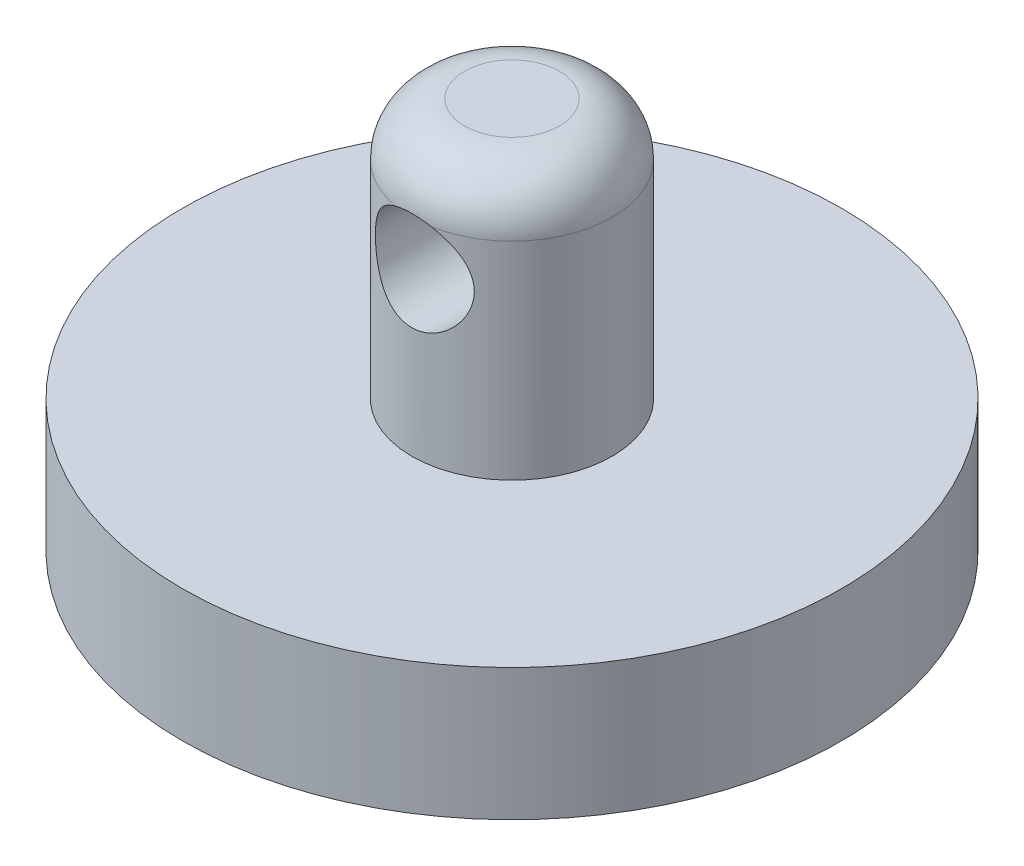
ISO-10303-21;
HEADER;
FILE_DESCRIPTION(('STEP AP214'),'2;1');
FILE_NAME('part.step','',(''),(''),'','','');
FILE_SCHEMA(('AUTOMOTIVE_DESIGN { 1 0 10303 214 1 1 1 1 }'));
ENDSEC;
DATA;
#1=APPLICATION_CONTEXT('core data for automotive mechanical design processes');
#2=APPLICATION_PROTOCOL_DEFINITION('international standard','automotive_design',2000,#1);
#3=PRODUCT_CONTEXT('',#1,'mechanical');
#4=PRODUCT('Part','Part','',(#3));
#5=PRODUCT_RELATED_PRODUCT_CATEGORY('part','',(#4));
#6=PRODUCT_DEFINITION_FORMATION('','',#4);
#7=PRODUCT_DEFINITION_CONTEXT('part definition',#1,'design');
#8=PRODUCT_DEFINITION('design','',#6,#7);
#9=PRODUCT_DEFINITION_SHAPE('','',#8);
#10=(LENGTH_UNIT() NAMED_UNIT(*) SI_UNIT(.MILLI.,.METRE.));
#11=(NAMED_UNIT(*) PLANE_ANGLE_UNIT() SI_UNIT($,.RADIAN.));
#12=(NAMED_UNIT(*) SI_UNIT($,.STERADIAN.) SOLID_ANGLE_UNIT());
#13=UNCERTAINTY_MEASURE_WITH_UNIT(LENGTH_MEASURE(1.E-05),#10,'distance_accuracy_value','');
#14=(GEOMETRIC_REPRESENTATION_CONTEXT(3) GLOBAL_UNCERTAINTY_ASSIGNED_CONTEXT((#13)) GLOBAL_UNIT_ASSIGNED_CONTEXT((#10,
#11,#12)) REPRESENTATION_CONTEXT('',''));
#15=CARTESIAN_POINT('',(0.,0.,0.));
#16=DIRECTION('',(0.,0.,1.));
#17=DIRECTION('',(1.,0.,0.));
#18=AXIS2_PLACEMENT_3D('',#15,#16,#17);
#19=CARTESIAN_POINT('',(0.,0.,0.));
#20=DIRECTION('',(0.,-1.,0.));
#21=DIRECTION('',(0.,0.,-1.));
#22=AXIS2_PLACEMENT_3D('',#19,#20,#21);
#23=PLANE('',#22);
#24=CARTESIAN_POINT('',(0.,0.,0.));
#25=DIRECTION('',(0.,1.,0.));
#26=DIRECTION('',(0.,0.,1.));
#27=AXIS2_PLACEMENT_3D('',#24,#25,#26);
#28=CIRCLE('',#27,2.28599999999998);
#29=CARTESIAN_POINT('',(0.,0.,2.28599999999998));
#30=VERTEX_POINT('',#29);
#31=EDGE_CURVE('E67',#30,#30,#28,.T.);
#32=ORIENTED_EDGE('',*,*,#31,.T.);
#33=EDGE_LOOP('',(#32));
#34=FACE_BOUND('',#33,.T.);
#35=ADVANCED_FACE('F32',(#34),#23,.F.);
#36=CARTESIAN_POINT('',(0.,-2.54,0.));
#37=DIRECTION('',(0.,1.,0.));
#38=DIRECTION('',(0.,0.,1.));
#39=AXIS2_PLACEMENT_3D('',#36,#37,#38);
#40=DEGENERATE_TOROIDAL_SURFACE('',#39,2.286,2.54,.T.);
#41=ORIENTED_EDGE('',*,*,#31,.F.);
#42=EDGE_LOOP('',(#41));
#43=FACE_BOUND('',#42,.T.);
#44=CARTESIAN_POINT('',(0.,-2.54000000000002,0.));
#45=DIRECTION('',(0.,1.,0.));
#46=DIRECTION('',(0.,0.,1.));
#47=AXIS2_PLACEMENT_3D('',#44,#45,#46);
#48=CIRCLE('',#47,4.826);
#49=CARTESIAN_POINT('',(-0.854894913132647,-2.54000000000002,-4.74967690348511));
#50=VERTEX_POINT('',#49);
#51=CARTESIAN_POINT('',(-0.854894913132647,-2.54000000000002,4.74967690348511));
#52=VERTEX_POINT('',#51);
#53=EDGE_CURVE('E72',#50,#52,#48,.T.);
#54=ORIENTED_EDGE('',*,*,#53,.T.);
#55=CARTESIAN_POINT('',(-0.855414678680976,-2.54020000000065,4.74958331345994));
#56=CARTESIAN_POINT('',(-0.798845324391578,-2.51841518183945,4.75977168585689));
#57=CARTESIAN_POINT('',(-0.741261008064853,-2.49873980990101,4.76881768916786));
#58=CARTESIAN_POINT('',(-0.624476488291599,-2.4637863719272,4.78469701894869));
#59=CARTESIAN_POINT('',(-0.565276314999579,-2.44850822389384,4.79153038667936));
#60=CARTESIAN_POINT('',(-0.445643026982296,-2.42252053251116,4.80305967126597));
#61=CARTESIAN_POINT('',(-0.385209329257438,-2.4118132044287,4.8077545517689));
#62=CARTESIAN_POINT('',(-0.263589746941185,-2.39508696531306,4.81505203007644));
#63=CARTESIAN_POINT('',(-0.202403897227714,-2.38906783771087,4.81765472452871));
#64=CARTESIAN_POINT('',(-0.0182782923249988,-2.37815389149867,4.82237883996243));
#65=CARTESIAN_POINT('',(0.105249390678226,-2.38039819367889,4.82141815759051));
#66=CARTESIAN_POINT('',(0.349916744366821,-2.40390247992268,4.81122056406166));
#67=CARTESIAN_POINT('',(0.471060391608101,-2.42512745938037,4.80199888796657));
#68=CARTESIAN_POINT('',(0.634620923965451,-2.46689346130696,4.78327439134968));
#69=CARTESIAN_POINT('',(0.679532622027652,-2.4797902369759,4.77744928779252));
#70=CARTESIAN_POINT('',(0.768291295196524,-2.50811684255922,4.76449994639135));
#71=CARTESIAN_POINT('',(0.812139616742324,-2.52354325406144,4.75737746033944));
#72=CARTESIAN_POINT('',(0.855414678680977,-2.54020000000065,4.74958331345994));
#73=B_SPLINE_CURVE_WITH_KNOTS('',3,(#55,#56,#57,#58,#59,#60,#61,#62,#63,#64,#65,#66,#67,#68,#69,
#70,#71,#72),.UNSPECIFIED.,.F.,.F.,(4,2,2,2,2,2,2,2,4),(0.,0.184348303482079,0.36869316907515,
0.553127277017148,0.737552864614694,1.1063435604013,1.4744555232586,1.61564262981383,
1.7566404927481),.UNSPECIFIED.);
#74=CARTESIAN_POINT('',(0.854894913132648,-2.54000000000002,4.74967690348511));
#75=VERTEX_POINT('',#74);
#76=EDGE_CURVE('E51',#52,#75,#73,.T.);
#77=ORIENTED_EDGE('',*,*,#76,.T.);
#78=CARTESIAN_POINT('',(0.854894913132648,-2.54000000000002,-4.74967690348511));
#79=VERTEX_POINT('',#78);
#80=EDGE_CURVE('E71',#75,#79,#48,.T.);
#81=ORIENTED_EDGE('',*,*,#80,.T.);
#82=CARTESIAN_POINT('',(0.855414678680977,-2.54020000000065,-4.74958331345994));
#83=CARTESIAN_POINT('',(0.798845324391578,-2.51841518183945,-4.75977168585689));
#84=CARTESIAN_POINT('',(0.741261008064853,-2.49873980990101,-4.76881768916786));
#85=CARTESIAN_POINT('',(0.6244764882916,-2.4637863719272,-4.78469701894869));
#86=CARTESIAN_POINT('',(0.565276314999579,-2.44850822389384,-4.79153038667936));
#87=CARTESIAN_POINT('',(0.445643026982297,-2.42252053251116,-4.80305967126597));
#88=CARTESIAN_POINT('',(0.385209329257439,-2.4118132044287,-4.8077545517689));
#89=CARTESIAN_POINT('',(0.263589746941186,-2.39508696531306,-4.81505203007644));
#90=CARTESIAN_POINT('',(0.202403897227715,-2.38906783771087,-4.81765472452871));
#91=CARTESIAN_POINT('',(0.0182782923249999,-2.37815389149867,-4.82237883996243));
#92=CARTESIAN_POINT('',(-0.105249390678225,-2.38039819367889,-4.82141815759051));
#93=CARTESIAN_POINT('',(-0.34991674436682,-2.40390247992268,-4.81122056406166));
#94=CARTESIAN_POINT('',(-0.4710603916081,-2.42512745938037,-4.80199888796657));
#95=CARTESIAN_POINT('',(-0.63462092396545,-2.46689346130695,-4.78327439134968));
#96=CARTESIAN_POINT('',(-0.679532622027651,-2.4797902369759,-4.77744928779252));
#97=CARTESIAN_POINT('',(-0.768291295196523,-2.50811684255922,-4.76449994639135));
#98=CARTESIAN_POINT('',(-0.812139616742324,-2.52354325406144,-4.75737746033944));
#99=CARTESIAN_POINT('',(-0.855414678680976,-2.54020000000065,-4.74958331345994));
#100=B_SPLINE_CURVE_WITH_KNOTS('',3,(#82,#83,#84,#85,#86,#87,#88,#89,#90,#91,#92,#93,#94,#95,
#96,#97,#98,#99),.UNSPECIFIED.,.F.,.F.,(4,2,2,2,2,2,2,2,4),(0.,0.184348303482079,
0.36869316907515,0.553127277017148,0.737552864614694,1.1063435604013,1.4744555232586,
1.61564262981383,1.7566404927481),.UNSPECIFIED.);
#101=EDGE_CURVE('E58',#79,#50,#100,.T.);
#102=ORIENTED_EDGE('',*,*,#101,.T.);
#103=EDGE_LOOP('',(#54,#77,#81,#102));
#104=FACE_BOUND('',#103,.T.);
#105=ADVANCED_FACE('F70',(#43,#104),#40,.T.);
#106=CARTESIAN_POINT('',(0.,0.,0.));
#107=DIRECTION('',(0.,1.,0.));
#108=DIRECTION('',(0.,0.,1.));
#109=AXIS2_PLACEMENT_3D('',#106,#107,#108);
#110=CYLINDRICAL_SURFACE('',#109,4.826);
#111=ORIENTED_EDGE('',*,*,#53,.F.);
#112=CARTESIAN_POINT('',(-0.854894913132647,-2.54000000000002,-4.74967690348511));
#113=CARTESIAN_POINT('',(-0.918697906129766,-2.56454262486804,-4.73819803028183));
#114=CARTESIAN_POINT('',(-0.981224683950843,-2.59174822008641,-4.72561072201682));
#115=CARTESIAN_POINT('',(-1.10336933098255,-2.65121090650748,-4.69859066607849));
#116=CARTESIAN_POINT('',(-1.16298882273051,-2.68346513678518,-4.68415896441787));
#117=CARTESIAN_POINT('',(-1.33672397672351,-2.78723611352102,-4.63871963124173));
#118=CARTESIAN_POINT('',(-1.4460874709041,-2.86590557496671,-4.60549743426115));
#119=CARTESIAN_POINT('',(-1.64938715078415,-3.03977915096064,-4.53666537173904));
#120=CARTESIAN_POINT('',(-1.74334965913681,-3.13495446897237,-4.50105972976353));
#121=CARTESIAN_POINT('',(-1.91436141127674,-3.34003635587842,-4.43103149961965));
#122=CARTESIAN_POINT('',(-1.99139432669877,-3.44995698334565,-4.39661008036572));
#123=CARTESIAN_POINT('',(-2.12866541624622,-3.6862078882421,-4.33186166261805));
#124=CARTESIAN_POINT('',(-2.18826477843525,-3.81296027190604,-4.30170746764923));
#125=CARTESIAN_POINT('',(-2.28464442023298,-4.07665301233523,-4.25131464004079));
#126=CARTESIAN_POINT('',(-2.32145628156328,-4.2135789729935,-4.23106229242726));
#127=CARTESIAN_POINT('',(-2.36789615950473,-4.47981976565405,-4.20523330627634));
#128=CARTESIAN_POINT('',(-2.37977352244394,-4.60862271078016,-4.19844573112953));
#129=CARTESIAN_POINT('',(-2.38246531467668,-4.86650222813918,-4.19692116085298));
#130=CARTESIAN_POINT('',(-2.37328749167973,-4.99557868226654,-4.20217973308262));
#131=CARTESIAN_POINT('',(-2.3362176745992,-5.23800958142674,-4.22288263817493));
#132=CARTESIAN_POINT('',(-2.31009881618014,-5.35172806871109,-4.23735972133812));
#133=CARTESIAN_POINT('',(-2.24204448185467,-5.57305678937097,-4.27375626840105));
#134=CARTESIAN_POINT('',(-2.20010421052479,-5.68066515939945,-4.29567798854706));
#135=CARTESIAN_POINT('',(-2.0984408123693,-5.89469500777598,-4.34629091077114));
#136=CARTESIAN_POINT('',(-2.03771404895297,-6.00055332616934,-4.37533740492223));
#137=CARTESIAN_POINT('',(-1.90132562646585,-6.20126805421784,-4.43630662075642));
#138=CARTESIAN_POINT('',(-1.82565543976383,-6.29611813259951,-4.46823097904459));
#139=CARTESIAN_POINT('',(-1.65110136482988,-6.48368884429494,-4.53584423785158));
#140=CARTESIAN_POINT('',(-1.55053506213778,-6.57485187155657,-4.57153504194166));
#141=CARTESIAN_POINT('',(-1.33455073319679,-6.73930188653307,-4.63918610009534));
#142=CARTESIAN_POINT('',(-1.2191306872774,-6.81258643937224,-4.67114584571606));
#143=CARTESIAN_POINT('',(-0.975539309221541,-6.9390942903712,-4.72803112151971));
#144=CARTESIAN_POINT('',(-0.847322962177582,-6.99224337063715,-4.75293054468792));
#145=CARTESIAN_POINT('',(-0.58219444367384,-7.07565067482056,-4.79262256106949));
#146=CARTESIAN_POINT('',(-0.445290055720089,-7.10592908301698,-4.8074240649791));
#147=CARTESIAN_POINT('',(-0.180851118794648,-7.14024978449016,-4.82425404419044));
#148=CARTESIAN_POINT('',(-0.0536727664306179,-7.14652441858962,-4.82736877925288));
#149=CARTESIAN_POINT('',(0.199888687164915,-7.13873052832653,-4.82352366194231));
#150=CARTESIAN_POINT('',(0.326271961388649,-7.12466659461493,-4.81656608300719));
#151=CARTESIAN_POINT('',(0.568138809473482,-7.07809711466594,-4.79390575004921));
#152=CARTESIAN_POINT('',(0.683851789293184,-7.04654441064228,-4.77865555666441));
#153=CARTESIAN_POINT('',(0.908230490841923,-6.96696093818696,-4.74113320244692));
#154=CARTESIAN_POINT('',(1.01689496712162,-6.91892726699795,-4.71885980468836));
#155=CARTESIAN_POINT('',(1.23084069416942,-6.80477910660687,-4.66777032829462));
#156=CARTESIAN_POINT('',(1.33558743672603,-6.73779924389603,-4.6386565998771));
#157=CARTESIAN_POINT('',(1.53288397685072,-6.58894746248519,-4.57725224141138));
#158=CARTESIAN_POINT('',(1.62542652766842,-6.50706676384706,-4.54495974353178));
#159=CARTESIAN_POINT('',(1.80496176245297,-6.32156481350912,-4.47688136746997));
#160=CARTESIAN_POINT('',(1.89056906608956,-6.21661115328117,-4.44105770005153));
#161=CARTESIAN_POINT('',(2.04324336283442,-5.99288619698136,-4.37292118485586));
#162=CARTESIAN_POINT('',(2.11030548597586,-5.8741112830585,-4.34060926061243));
#163=CARTESIAN_POINT('',(2.22408542382287,-5.62432794914865,-4.2834361924549));
#164=CARTESIAN_POINT('',(2.27065281791041,-5.49323737561122,-4.25863054198336));
#165=CARTESIAN_POINT('',(2.34035362629354,-5.22341105933853,-4.220739919429));
#166=CARTESIAN_POINT('',(2.36352047589663,-5.08468652412647,-4.20763822753071));
#167=CARTESIAN_POINT('',(2.38375171276014,-4.82120658731006,-4.19620122770495));
#168=CARTESIAN_POINT('',(2.38356249529589,-4.6967243598064,-4.19631220564923));
#169=CARTESIAN_POINT('',(2.36387505352875,-4.44980111002393,-4.20743343067267));
#170=CARTESIAN_POINT('',(2.34437678838527,-4.32736009206304,-4.21844370080494));
#171=CARTESIAN_POINT('',(2.2885588556227,-4.0943037330664,-4.24896540656508));
#172=CARTESIAN_POINT('',(2.25315173722372,-3.98340389597403,-4.26801262771717));
#173=CARTESIAN_POINT('',(2.16716714143362,-3.76897452328591,-4.31230700515303));
#174=CARTESIAN_POINT('',(2.1165830071932,-3.6654482465418,-4.33755688112441));
#175=CARTESIAN_POINT('',(1.99580974530487,-3.4575179104816,-4.39453161681926));
#176=CARTESIAN_POINT('',(1.92416030615849,-3.35407322458577,-4.4266523189385));
#177=CARTESIAN_POINT('',(1.76572495733624,-3.15992146249739,-4.49219574251483));
#178=CARTESIAN_POINT('',(1.67893707577731,-3.06921604846186,-4.52561863314965));
#179=CARTESIAN_POINT('',(1.53243862543094,-2.9384830467379,-4.57657833332629));
#180=CARTESIAN_POINT('',(1.4772692772319,-2.89351470587481,-4.59472904166961));
#181=CARTESIAN_POINT('',(1.36288914902576,-2.80854056994953,-4.62994461727904));
#182=CARTESIAN_POINT('',(1.30367853161966,-2.76853457540892,-4.64700952817904));
#183=CARTESIAN_POINT('',(1.18143391857,-2.69375421440278,-4.67958256634308));
#184=CARTESIAN_POINT('',(1.11839144434224,-2.65899208932194,-4.69508702363469));
#185=CARTESIAN_POINT('',(0.98900482335215,-2.59514298284769,-4.72404165165338));
#186=CARTESIAN_POINT('',(0.922658906334727,-2.56605908630101,-4.73749070487124));
#187=CARTESIAN_POINT('',(0.854894913132648,-2.54000000000002,-4.74967690348511));
#188=B_SPLINE_CURVE_WITH_KNOTS('',3,(#112,#113,#114,#115,#116,#117,#118,#119,#120,#121,#122,
#123,#124,#125,#126,#127,#128,#129,#130,#131,#132,#133,#134,#135,#136,#137,#138,#139,#140,#141,
#142,#143,#144,#145,#146,#147,#148,#149,#150,#151,#152,#153,#154,#155,#156,#157,#158,#159,#160,
#161,#162,#163,#164,#165,#166,#167,#168,#169,#170,#171,#172,#173,#174,#175,#176,#177,#178,#179,
#180,#181,#182,#183,#184,#185,#186,#187),.UNSPECIFIED.,.F.,.F.,(4,2,2,2,2,2,2,2,2,2,2,2,2,2,2,2,
2,2,2,2,2,2,2,2,2,2,2,2,2,2,2,2,2,2,2,2,2,4),(0.,0.207794502204886,0.415471676357561,
0.829629114813826,1.24307114179933,1.65691019492101,2.08441911203186,2.51133420034398,
2.89771121264921,3.28394607200971,3.63514451946428,3.98644949976798,4.36130506175265,
4.73637516063931,5.15548330534395,5.57464849670954,5.99534400695978,6.41566780146414,
6.79579027227992,7.17582695842959,7.5369460382641,7.89812875390314,8.27963680281305,
8.66137037778267,9.07974580771006,9.49823099897697,9.91973841655128,10.3406427177694,
10.7121069960263,11.0835720599694,11.4360145618456,11.7886118764326,12.1766796883659,
12.5647980865177,12.7849102768897,13.0050136162328,13.2256230716718,13.4463520475039),.UNSPECIFIED.);
#189=EDGE_CURVE('E11',#50,#79,#188,.T.);
#190=ORIENTED_EDGE('',*,*,#189,.T.);
#191=ORIENTED_EDGE('',*,*,#80,.F.);
#192=CARTESIAN_POINT('',(0.854894913132648,-2.54000000000002,4.74967690348511));
#193=CARTESIAN_POINT('',(0.918697906129767,-2.56454262486804,4.73819803028183));
#194=CARTESIAN_POINT('',(0.981224683950844,-2.59174822008641,4.72561072201682));
#195=CARTESIAN_POINT('',(1.10336933098255,-2.65121090650748,4.69859066607849));
#196=CARTESIAN_POINT('',(1.16298882273051,-2.68346513678518,4.68415896441787));
#197=CARTESIAN_POINT('',(1.33672397672351,-2.78723611352102,4.63871963124173));
#198=CARTESIAN_POINT('',(1.4460874709041,-2.86590557496671,4.60549743426116));
#199=CARTESIAN_POINT('',(1.64938715078415,-3.03977915096064,4.53666537173904));
#200=CARTESIAN_POINT('',(1.74334965913681,-3.13495446897237,4.50105972976353));
#201=CARTESIAN_POINT('',(1.91436141127674,-3.34003635587841,4.43103149961965));
#202=CARTESIAN_POINT('',(1.99139432669877,-3.44995698334565,4.39661008036572));
#203=CARTESIAN_POINT('',(2.12866541624622,-3.6862078882421,4.33186166261805));
#204=CARTESIAN_POINT('',(2.18826477843525,-3.81296027190604,4.30170746764923));
#205=CARTESIAN_POINT('',(2.28464442023298,-4.07665301233523,4.25131464004079));
#206=CARTESIAN_POINT('',(2.32145628156328,-4.2135789729935,4.23106229242725));
#207=CARTESIAN_POINT('',(2.36789615950473,-4.47981976565405,4.20523330627634));
#208=CARTESIAN_POINT('',(2.37977352244394,-4.60862271078016,4.19844573112953));
#209=CARTESIAN_POINT('',(2.38246531467668,-4.86650222813918,4.19692116085298));
#210=CARTESIAN_POINT('',(2.37328749167973,-4.99557868226654,4.20217973308262));
#211=CARTESIAN_POINT('',(2.3362176745992,-5.23800958142674,4.22288263817493));
#212=CARTESIAN_POINT('',(2.31009881618014,-5.35172806871108,4.23735972133812));
#213=CARTESIAN_POINT('',(2.24204448185467,-5.57305678937097,4.27375626840105));
#214=CARTESIAN_POINT('',(2.20010421052479,-5.68066515939945,4.29567798854706));
#215=CARTESIAN_POINT('',(2.0984408123693,-5.89469500777598,4.34629091077114));
#216=CARTESIAN_POINT('',(2.03771404895297,-6.00055332616934,4.37533740492223));
#217=CARTESIAN_POINT('',(1.90132562646585,-6.20126805421784,4.43630662075642));
#218=CARTESIAN_POINT('',(1.82565543976383,-6.29611813259951,4.46823097904459));
#219=CARTESIAN_POINT('',(1.65110136482988,-6.48368884429494,4.53584423785158));
#220=CARTESIAN_POINT('',(1.55053506213778,-6.57485187155657,4.57153504194166));
#221=CARTESIAN_POINT('',(1.33455073319679,-6.73930188653307,4.63918610009534));
#222=CARTESIAN_POINT('',(1.2191306872774,-6.81258643937224,4.67114584571606));
#223=CARTESIAN_POINT('',(0.975539309221544,-6.9390942903712,4.72803112151971));
#224=CARTESIAN_POINT('',(0.847322962177585,-6.99224337063715,4.75293054468792));
#225=CARTESIAN_POINT('',(0.582194443673843,-7.07565067482056,4.79262256106949));
#226=CARTESIAN_POINT('',(0.445290055720091,-7.10592908301698,4.8074240649791));
#227=CARTESIAN_POINT('',(0.180851118794649,-7.14024978449016,4.82425404419044));
#228=CARTESIAN_POINT('',(0.0536727664306192,-7.14652441858962,4.82736877925288));
#229=CARTESIAN_POINT('',(-0.199888687164914,-7.13873052832653,4.82352366194231));
#230=CARTESIAN_POINT('',(-0.326271961388648,-7.12466659461493,4.81656608300719));
#231=CARTESIAN_POINT('',(-0.568138809473481,-7.07809711466594,4.79390575004921));
#232=CARTESIAN_POINT('',(-0.683851789293182,-7.04654441064228,4.77865555666441));
#233=CARTESIAN_POINT('',(-0.908230490841921,-6.96696093818696,4.74113320244692));
#234=CARTESIAN_POINT('',(-1.01689496712162,-6.91892726699795,4.71885980468836));
#235=CARTESIAN_POINT('',(-1.23084069416942,-6.80477910660687,4.66777032829463));
#236=CARTESIAN_POINT('',(-1.33558743672603,-6.73779924389603,4.6386565998771));
#237=CARTESIAN_POINT('',(-1.53288397685072,-6.58894746248519,4.57725224141138));
#238=CARTESIAN_POINT('',(-1.62542652766842,-6.50706676384706,4.54495974353178));
#239=CARTESIAN_POINT('',(-1.80496176245297,-6.32156481350912,4.47688136746997));
#240=CARTESIAN_POINT('',(-1.89056906608956,-6.21661115328117,4.44105770005153));
#241=CARTESIAN_POINT('',(-2.04324336283442,-5.99288619698136,4.37292118485586));
#242=CARTESIAN_POINT('',(-2.11030548597586,-5.8741112830585,4.34060926061243));
#243=CARTESIAN_POINT('',(-2.22408542382287,-5.62432794914865,4.2834361924549));
#244=CARTESIAN_POINT('',(-2.27065281791041,-5.49323737561122,4.25863054198336));
#245=CARTESIAN_POINT('',(-2.34035362629354,-5.22341105933853,4.220739919429));
#246=CARTESIAN_POINT('',(-2.36352047589662,-5.08468652412647,4.20763822753071));
#247=CARTESIAN_POINT('',(-2.38375171276014,-4.82120658731006,4.19620122770495));
#248=CARTESIAN_POINT('',(-2.38356249529589,-4.6967243598064,4.19631220564923));
#249=CARTESIAN_POINT('',(-2.36387505352875,-4.44980111002393,4.20743343067268));
#250=CARTESIAN_POINT('',(-2.34437678838527,-4.32736009206304,4.21844370080494));
#251=CARTESIAN_POINT('',(-2.2885588556227,-4.0943037330664,4.24896540656508));
#252=CARTESIAN_POINT('',(-2.25315173722372,-3.98340389597402,4.26801262771717));
#253=CARTESIAN_POINT('',(-2.16716714143362,-3.76897452328591,4.31230700515303));
#254=CARTESIAN_POINT('',(-2.1165830071932,-3.6654482465418,4.33755688112441));
#255=CARTESIAN_POINT('',(-1.99580974530487,-3.4575179104816,4.39453161681926));
#256=CARTESIAN_POINT('',(-1.92416030615849,-3.35407322458577,4.4266523189385));
#257=CARTESIAN_POINT('',(-1.76572495733623,-3.15992146249739,4.49219574251484));
#258=CARTESIAN_POINT('',(-1.67893707577731,-3.06921604846186,4.52561863314965));
#259=CARTESIAN_POINT('',(-1.53243862543093,-2.9384830467379,4.57657833332629));
#260=CARTESIAN_POINT('',(-1.4772692772319,-2.89351470587481,4.59472904166961));
#261=CARTESIAN_POINT('',(-1.36288914902575,-2.80854056994953,4.62994461727904));
#262=CARTESIAN_POINT('',(-1.30367853161965,-2.76853457540892,4.64700952817904));
#263=CARTESIAN_POINT('',(-1.18143391856999,-2.69375421440278,4.67958256634308));
#264=CARTESIAN_POINT('',(-1.11839144434224,-2.65899208932194,4.69508702363469));
#265=CARTESIAN_POINT('',(-0.989004823352148,-2.59514298284769,4.72404165165338));
#266=CARTESIAN_POINT('',(-0.922658906334725,-2.56605908630102,4.73749070487124));
#267=CARTESIAN_POINT('',(-0.854894913132648,-2.54000000000002,4.74967690348511));
#268=B_SPLINE_CURVE_WITH_KNOTS('',3,(#192,#193,#194,#195,#196,#197,#198,#199,#200,#201,#202,
#203,#204,#205,#206,#207,#208,#209,#210,#211,#212,#213,#214,#215,#216,#217,#218,#219,#220,#221,
#222,#223,#224,#225,#226,#227,#228,#229,#230,#231,#232,#233,#234,#235,#236,#237,#238,#239,#240,
#241,#242,#243,#244,#245,#246,#247,#248,#249,#250,#251,#252,#253,#254,#255,#256,#257,#258,#259,
#260,#261,#262,#263,#264,#265,#266,#267),.UNSPECIFIED.,.F.,.F.,(4,2,2,2,2,2,2,2,2,2,2,2,2,2,2,2,
2,2,2,2,2,2,2,2,2,2,2,2,2,2,2,2,2,2,2,2,2,4),(0.,0.207794502204886,0.415471676357561,
0.829629114813826,1.24307114179933,1.65691019492101,2.08441911203186,2.51133420034398,
2.89771121264921,3.28394607200971,3.63514451946428,3.98644949976798,4.36130506175265,
4.73637516063931,5.15548330534395,5.57464849670954,5.99534400695978,6.41566780146414,
6.79579027227992,7.17582695842959,7.5369460382641,7.89812875390314,8.27963680281305,
8.66137037778267,9.07974580771006,9.49823099897697,9.91973841655128,10.3406427177694,
10.7121069960263,11.0835720599694,11.4360145618456,11.7886118764326,12.1766796883659,
12.5647980865177,12.7849102768897,13.0050136162328,13.2256230716718,13.4463520475039),.UNSPECIFIED.);
#269=EDGE_CURVE('E45',#75,#52,#268,.T.);
#270=ORIENTED_EDGE('',*,*,#269,.T.);
#271=EDGE_LOOP('',(#111,#190,#191,#270));
#272=FACE_BOUND('',#271,.T.);
#273=CARTESIAN_POINT('',(0.,-12.5095,0.));
#274=DIRECTION('',(0.,1.,0.));
#275=DIRECTION('',(0.,0.,1.));
#276=AXIS2_PLACEMENT_3D('',#273,#274,#275);
#277=CIRCLE('',#276,4.826);
#278=CARTESIAN_POINT('',(0.,-12.5095,4.826));
#279=VERTEX_POINT('',#278);
#280=EDGE_CURVE('E79',#279,#279,#277,.T.);
#281=ORIENTED_EDGE('',*,*,#280,.T.);
#282=EDGE_LOOP('',(#281));
#283=FACE_BOUND('',#282,.T.);
#284=ADVANCED_FACE('F74',(#272,#283),#110,.T.);
#285=CARTESIAN_POINT('',(4.826,-12.5095,0.));
#286=DIRECTION('',(0.,-1.,0.));
#287=DIRECTION('',(0.,0.,-1.));
#288=AXIS2_PLACEMENT_3D('',#285,#286,#287);
#289=PLANE('',#288);
#290=ORIENTED_EDGE('',*,*,#280,.F.);
#291=EDGE_LOOP('',(#290));
#292=FACE_BOUND('',#291,.T.);
#293=CARTESIAN_POINT('',(0.,-12.5095,0.));
#294=DIRECTION('',(0.,1.,0.));
#295=DIRECTION('',(0.,0.,1.));
#296=AXIS2_PLACEMENT_3D('',#293,#294,#295);
#297=CIRCLE('',#296,15.875);
#298=CARTESIAN_POINT('',(0.,-12.5095,15.875));
#299=VERTEX_POINT('',#298);
#300=EDGE_CURVE('E194',#299,#299,#297,.T.);
#301=ORIENTED_EDGE('',*,*,#300,.T.);
#302=EDGE_LOOP('',(#301));
#303=FACE_BOUND('',#302,.T.);
#304=ADVANCED_FACE('F114',(#292,#303),#289,.F.);
#305=CARTESIAN_POINT('',(0.,0.,0.));
#306=DIRECTION('',(0.,1.,0.));
#307=DIRECTION('',(0.,0.,1.));
#308=AXIS2_PLACEMENT_3D('',#305,#306,#307);
#309=CYLINDRICAL_SURFACE('',#308,15.875);
#310=ORIENTED_EDGE('',*,*,#300,.F.);
#311=EDGE_LOOP('',(#310));
#312=FACE_BOUND('',#311,.T.);
#313=CARTESIAN_POINT('',(0.,-18.8595,0.));
#314=DIRECTION('',(0.,1.,0.));
#315=DIRECTION('',(0.,0.,1.));
#316=AXIS2_PLACEMENT_3D('',#313,#314,#315);
#317=CIRCLE('',#316,15.875);
#318=CARTESIAN_POINT('',(0.,-18.8595,15.875));
#319=VERTEX_POINT('',#318);
#320=EDGE_CURVE('E190',#319,#319,#317,.T.);
#321=ORIENTED_EDGE('',*,*,#320,.T.);
#322=EDGE_LOOP('',(#321));
#323=FACE_BOUND('',#322,.T.);
#324=ADVANCED_FACE('F129',(#312,#323),#309,.T.);
#325=CARTESIAN_POINT('',(15.875,-18.8595,0.));
#326=DIRECTION('',(0.,1.,0.));
#327=DIRECTION('',(0.,0.,1.));
#328=AXIS2_PLACEMENT_3D('',#325,#326,#327);
#329=PLANE('',#328);
#330=ORIENTED_EDGE('',*,*,#320,.F.);
#331=EDGE_LOOP('',(#330));
#332=FACE_BOUND('',#331,.T.);
#333=CARTESIAN_POINT('',(0.,-18.8595,0.));
#334=DIRECTION('',(0.,1.,0.));
#335=DIRECTION('',(0.,0.,1.));
#336=AXIS2_PLACEMENT_3D('',#333,#334,#335);
#337=CIRCLE('',#336,12.7);
#338=CARTESIAN_POINT('',(0.,-18.8595,12.7));
#339=VERTEX_POINT('',#338);
#340=EDGE_CURVE('E188',#339,#339,#337,.T.);
#341=ORIENTED_EDGE('',*,*,#340,.T.);
#342=EDGE_LOOP('',(#341));
#343=FACE_BOUND('',#342,.T.);
#344=ADVANCED_FACE('F139',(#332,#343),#329,.F.);
#345=CARTESIAN_POINT('',(0.,0.,0.));
#346=DIRECTION('',(0.,1.,0.));
#347=DIRECTION('',(0.,0.,1.));
#348=AXIS2_PLACEMENT_3D('',#345,#346,#347);
#349=CYLINDRICAL_SURFACE('',#348,12.7);
#350=ORIENTED_EDGE('',*,*,#340,.F.);
#351=EDGE_LOOP('',(#350));
#352=FACE_BOUND('',#351,.T.);
#353=CARTESIAN_POINT('',(0.,-15.6845,0.));
#354=DIRECTION('',(0.,1.,0.));
#355=DIRECTION('',(0.,0.,1.));
#356=AXIS2_PLACEMENT_3D('',#353,#354,#355);
#357=CIRCLE('',#356,12.7);
#358=CARTESIAN_POINT('',(0.,-15.6845,12.7));
#359=VERTEX_POINT('',#358);
#360=EDGE_CURVE('E186',#359,#359,#357,.T.);
#361=ORIENTED_EDGE('',*,*,#360,.T.);
#362=EDGE_LOOP('',(#361));
#363=FACE_BOUND('',#362,.T.);
#364=ADVANCED_FACE('F149',(#352,#363),#349,.F.);
#365=CARTESIAN_POINT('',(12.7,-15.6845,0.));
#366=DIRECTION('',(0.,1.,0.));
#367=DIRECTION('',(0.,0.,1.));
#368=AXIS2_PLACEMENT_3D('',#365,#366,#367);
#369=PLANE('',#368);
#370=ORIENTED_EDGE('',*,*,#360,.F.);
#371=EDGE_LOOP('',(#370));
#372=FACE_BOUND('',#371,.T.);
#373=ADVANCED_FACE('F91',(#372),#369,.F.);
#374=CARTESIAN_POINT('',(0.,-4.7625,-14.2190547184137));
#375=DIRECTION('',(0.,0.,1.));
#376=DIRECTION('',(1.,0.,0.));
#377=AXIS2_PLACEMENT_3D('',#374,#375,#376);
#378=CYLINDRICAL_SURFACE('',#377,2.38125);
#379=ORIENTED_EDGE('',*,*,#269,.F.);
#380=ORIENTED_EDGE('',*,*,#76,.F.);
#381=EDGE_LOOP('',(#379,#380));
#382=FACE_BOUND('',#381,.T.);
#383=ORIENTED_EDGE('',*,*,#189,.F.);
#384=ORIENTED_EDGE('',*,*,#101,.F.);
#385=EDGE_LOOP('',(#383,#384));
#386=FACE_BOUND('',#385,.T.);
#387=ADVANCED_FACE('F62',(#382,#386),#378,.F.);
#388=CLOSED_SHELL('',(#35,#105,#284,#304,#324,#344,#364,#373,#387));
#389=MANIFOLD_SOLID_BREP('B2',#388);
#390=ADVANCED_BREP_SHAPE_REPRESENTATION('',(#18,#389),#14);
#391=SHAPE_DEFINITION_REPRESENTATION(#9,#390);
ENDSEC;
END-ISO-10303-21;
